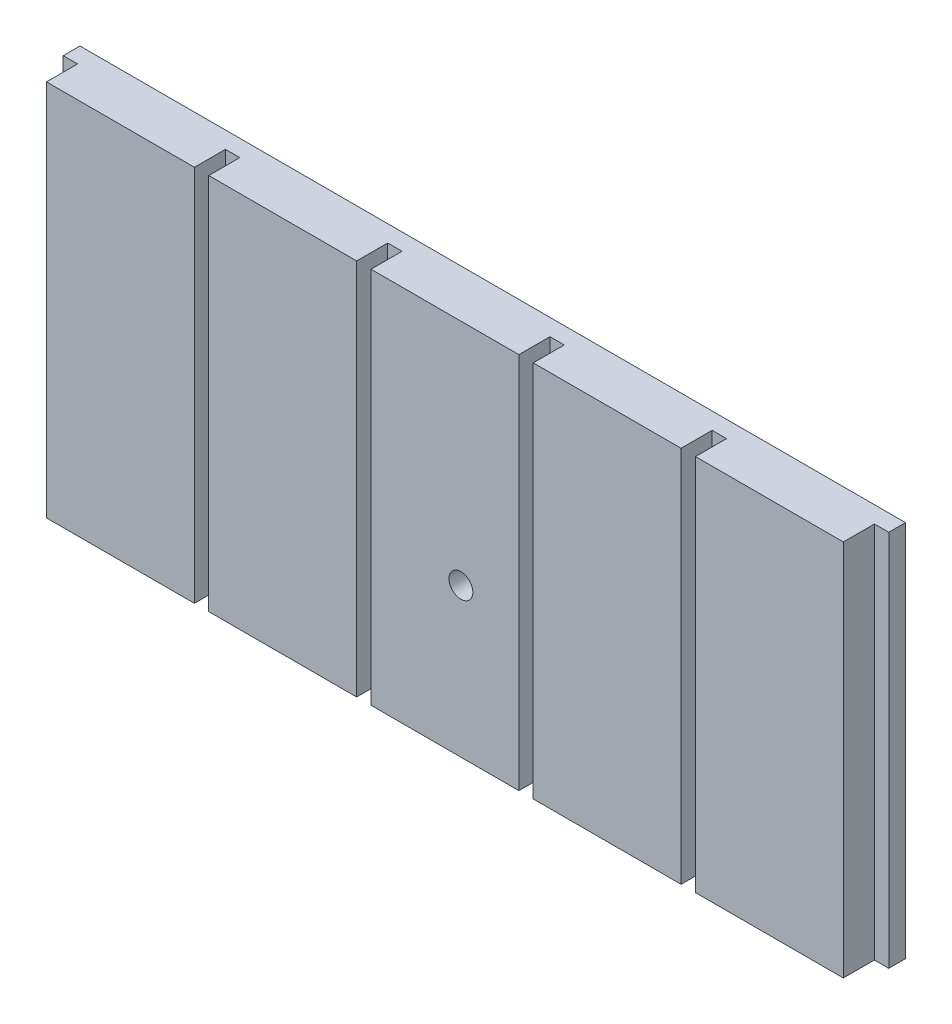
ISO-10303-21;
HEADER;
FILE_DESCRIPTION(('STEP AP214'),'2;1');
FILE_NAME('part.step','',(''),(''),'','','');
FILE_SCHEMA(('AUTOMOTIVE_DESIGN { 1 0 10303 214 1 1 1 1 }'));
ENDSEC;
DATA;
#1=APPLICATION_CONTEXT('core data for automotive mechanical design processes');
#2=APPLICATION_PROTOCOL_DEFINITION('international standard','automotive_design',2000,#1);
#3=PRODUCT_CONTEXT('',#1,'mechanical');
#4=PRODUCT('Part','Part','',(#3));
#5=PRODUCT_RELATED_PRODUCT_CATEGORY('part','',(#4));
#6=PRODUCT_DEFINITION_FORMATION('','',#4);
#7=PRODUCT_DEFINITION_CONTEXT('part definition',#1,'design');
#8=PRODUCT_DEFINITION('design','',#6,#7);
#9=PRODUCT_DEFINITION_SHAPE('','',#8);
#10=(LENGTH_UNIT() NAMED_UNIT(*) SI_UNIT(.MILLI.,.METRE.));
#11=(NAMED_UNIT(*) PLANE_ANGLE_UNIT() SI_UNIT($,.RADIAN.));
#12=(NAMED_UNIT(*) SI_UNIT($,.STERADIAN.) SOLID_ANGLE_UNIT());
#13=UNCERTAINTY_MEASURE_WITH_UNIT(LENGTH_MEASURE(1.E-05),#10,'distance_accuracy_value','');
#14=(GEOMETRIC_REPRESENTATION_CONTEXT(3) GLOBAL_UNCERTAINTY_ASSIGNED_CONTEXT((#13)) GLOBAL_UNIT_ASSIGNED_CONTEXT((#10,
#11,#12)) REPRESENTATION_CONTEXT('',''));
#15=CARTESIAN_POINT('',(0.,0.,0.));
#16=DIRECTION('',(0.,0.,1.));
#17=DIRECTION('',(1.,0.,0.));
#18=AXIS2_PLACEMENT_3D('',#15,#16,#17);
#19=CARTESIAN_POINT('',(0.,0.,0.));
#20=DIRECTION('',(0.,0.,1.));
#21=DIRECTION('',(-1.,0.,0.));
#22=AXIS2_PLACEMENT_3D('',#19,#20,#21);
#23=PLANE('',#22);
#24=DIRECTION('',(0.,1.,0.));
#25=VECTOR('',#24,1.);
#26=CARTESIAN_POINT('',(-49.4064909033683,-39.501,-9.47941669413857E-13));
#27=LINE('',#26,#25);
#28=CARTESIAN_POINT('',(-49.4064909033683,-39.4999999999999,-9.47941669413857E-13));
#29=VERTEX_POINT('',#28);
#30=CARTESIAN_POINT('',(-49.4064909033683,39.4999999999999,-9.47941669413857E-13));
#31=VERTEX_POINT('',#30);
#32=EDGE_CURVE('E349',#29,#31,#27,.T.);
#33=ORIENTED_EDGE('',*,*,#32,.F.);
#34=DIRECTION('',(1.,0.,0.));
#35=VECTOR('',#34,1.);
#36=CARTESIAN_POINT('',(-86.3441515056138,-39.4999999999999,0.));
#37=LINE('',#36,#35);
#38=CARTESIAN_POINT('',(-18.4688303011228,-39.4999999999999,0.));
#39=VERTEX_POINT('',#38);
#40=EDGE_CURVE('E231',#29,#39,#37,.T.);
#41=ORIENTED_EDGE('',*,*,#40,.T.);
#42=DIRECTION('',(0.,1.,0.));
#43=VECTOR('',#42,1.);
#44=CARTESIAN_POINT('',(-18.4688303011228,-39.501,-7.11507343120009E-13));
#45=LINE('',#44,#43);
#46=CARTESIAN_POINT('',(-18.4688303011228,39.4999999999999,-7.11507343120009E-13));
#47=VERTEX_POINT('',#46);
#48=EDGE_CURVE('E324',#39,#47,#45,.T.);
#49=ORIENTED_EDGE('',*,*,#48,.T.);
#50=DIRECTION('',(-1.,0.,0.));
#51=VECTOR('',#50,1.);
#52=CARTESIAN_POINT('',(-86.3441515056138,39.4999999999999,0.));
#53=LINE('',#52,#51);
#54=EDGE_CURVE('E388',#47,#31,#53,.T.);
#55=ORIENTED_EDGE('',*,*,#54,.T.);
#56=EDGE_LOOP('',(#33,#41,#49,#55));
#57=FACE_BOUND('',#56,.T.);
#58=ADVANCED_FACE('F37',(#57),#23,.T.);
#59=DIRECTION('',(0.,1.,0.));
#60=VECTOR('',#59,1.);
#61=CARTESIAN_POINT('',(-15.4688303011228,-39.501,-7.10956252060392E-13));
#62=LINE('',#61,#60);
#63=CARTESIAN_POINT('',(-15.4688303011228,-39.4999999999999,-7.10956252060392E-13));
#64=VERTEX_POINT('',#63);
#65=CARTESIAN_POINT('',(-15.4688303011228,39.4999999999999,-7.10956252060392E-13));
#66=VERTEX_POINT('',#65);
#67=EDGE_CURVE('E323',#64,#66,#62,.T.);
#68=ORIENTED_EDGE('',*,*,#67,.F.);
#69=CARTESIAN_POINT('',(15.4688303011228,-39.4999999999999,0.));
#70=VERTEX_POINT('',#69);
#71=EDGE_CURVE('E412',#64,#70,#37,.T.);
#72=ORIENTED_EDGE('',*,*,#71,.T.);
#73=DIRECTION('',(0.,1.,0.));
#74=VECTOR('',#73,1.);
#75=CARTESIAN_POINT('',(15.4688303011228,-39.501,-4.74521925766545E-13));
#76=LINE('',#75,#74);
#77=CARTESIAN_POINT('',(15.4688303011228,39.4999999999999,-4.74521925766545E-13));
#78=VERTEX_POINT('',#77);
#79=EDGE_CURVE('E298',#70,#78,#76,.T.);
#80=ORIENTED_EDGE('',*,*,#79,.T.);
#81=EDGE_CURVE('E390',#78,#66,#53,.T.);
#82=ORIENTED_EDGE('',*,*,#81,.T.);
#83=EDGE_LOOP('',(#68,#72,#80,#82));
#84=FACE_BOUND('',#83,.T.);
#85=CARTESIAN_POINT('',(3.3372047050014,-8.38677821628897,0.));
#86=DIRECTION('',(0.,0.,1.));
#87=DIRECTION('',(1.,0.,0.));
#88=AXIS2_PLACEMENT_3D('',#85,#86,#87);
#89=CIRCLE('',#88,2.5);
#90=CARTESIAN_POINT('',(5.8372047050014,-8.38677821628897,0.));
#91=VERTEX_POINT('',#90);
#92=EDGE_CURVE('E245',#91,#91,#89,.T.);
#93=ORIENTED_EDGE('',*,*,#92,.F.);
#94=EDGE_LOOP('',(#93));
#95=FACE_BOUND('',#94,.T.);
#96=ADVANCED_FACE('F445',(#84,#95),#23,.T.);
#97=DIRECTION('',(0.,1.,0.));
#98=VECTOR('',#97,1.);
#99=CARTESIAN_POINT('',(18.4688303011228,-39.501,-4.73970834706928E-13));
#100=LINE('',#99,#98);
#101=CARTESIAN_POINT('',(18.4688303011228,-39.4999999999999,-4.73970834706928E-13));
#102=VERTEX_POINT('',#101);
#103=CARTESIAN_POINT('',(18.4688303011228,39.4999999999999,-4.73970834706928E-13));
#104=VERTEX_POINT('',#103);
#105=EDGE_CURVE('E297',#102,#104,#100,.T.);
#106=ORIENTED_EDGE('',*,*,#105,.F.);
#107=CARTESIAN_POINT('',(49.4064909033683,-39.4999999999999,0.));
#108=VERTEX_POINT('',#107);
#109=EDGE_CURVE('E410',#102,#108,#37,.T.);
#110=ORIENTED_EDGE('',*,*,#109,.T.);
#111=DIRECTION('',(0.,1.,0.));
#112=VECTOR('',#111,1.);
#113=CARTESIAN_POINT('',(49.4064909033683,-39.501,-2.3753650841308E-13));
#114=LINE('',#113,#112);
#115=CARTESIAN_POINT('',(49.4064909033683,39.4999999999999,-2.3753650841308E-13));
#116=VERTEX_POINT('',#115);
#117=EDGE_CURVE('E272',#108,#116,#114,.T.);
#118=ORIENTED_EDGE('',*,*,#117,.T.);
#119=EDGE_CURVE('E236',#116,#104,#53,.T.);
#120=ORIENTED_EDGE('',*,*,#119,.T.);
#121=EDGE_LOOP('',(#106,#110,#118,#120));
#122=FACE_BOUND('',#121,.T.);
#123=ADVANCED_FACE('F402',(#122),#23,.T.);
#124=DIRECTION('',(0.,1.,0.));
#125=VECTOR('',#124,1.);
#126=CARTESIAN_POINT('',(52.4064909033683,-39.501,-2.36985417353464E-13));
#127=LINE('',#126,#125);
#128=CARTESIAN_POINT('',(52.4064909033683,-39.4999999999999,-2.36985417353464E-13));
#129=VERTEX_POINT('',#128);
#130=CARTESIAN_POINT('',(52.4064909033683,39.4999999999999,-2.36985417353464E-13));
#131=VERTEX_POINT('',#130);
#132=EDGE_CURVE('E271',#129,#131,#127,.T.);
#133=ORIENTED_EDGE('',*,*,#132,.F.);
#134=CARTESIAN_POINT('',(83.3441515056138,-39.4999999999999,0.));
#135=VERTEX_POINT('',#134);
#136=EDGE_CURVE('E232',#129,#135,#37,.T.);
#137=ORIENTED_EDGE('',*,*,#136,.T.);
#138=DIRECTION('',(0.,1.,0.));
#139=VECTOR('',#138,1.);
#140=CARTESIAN_POINT('',(83.3441515056138,-39.501,0.));
#141=LINE('',#140,#139);
#142=CARTESIAN_POINT('',(83.3441515056138,39.4999999999999,0.));
#143=VERTEX_POINT('',#142);
#144=EDGE_CURVE('E254',#135,#143,#141,.T.);
#145=ORIENTED_EDGE('',*,*,#144,.T.);
#146=EDGE_CURVE('E233',#143,#131,#53,.T.);
#147=ORIENTED_EDGE('',*,*,#146,.T.);
#148=EDGE_LOOP('',(#133,#137,#145,#147));
#149=FACE_BOUND('',#148,.T.);
#150=ADVANCED_FACE('F418',(#149),#23,.T.);
#151=CARTESIAN_POINT('',(0.,0.,-10.));
#152=DIRECTION('',(0.,0.,1.));
#153=DIRECTION('',(-1.,0.,0.));
#154=AXIS2_PLACEMENT_3D('',#151,#152,#153);
#155=PLANE('',#154);
#156=DIRECTION('',(0.,1.,0.));
#157=VECTOR('',#156,1.);
#158=CARTESIAN_POINT('',(86.3441515056138,-39.4999999999999,-10.));
#159=LINE('',#158,#157);
#160=CARTESIAN_POINT('',(86.3441515056138,-39.4999999999999,-10.));
#161=VERTEX_POINT('',#160);
#162=CARTESIAN_POINT('',(86.3441515056138,39.4999999999999,-10.));
#163=VERTEX_POINT('',#162);
#164=EDGE_CURVE('E230',#161,#163,#159,.T.);
#165=ORIENTED_EDGE('',*,*,#164,.F.);
#166=DIRECTION('',(1.,0.,0.));
#167=VECTOR('',#166,1.);
#168=CARTESIAN_POINT('',(-86.3441515056138,-39.4999999999999,-10.));
#169=LINE('',#168,#167);
#170=CARTESIAN_POINT('',(-86.3441515056138,-39.4999999999999,-10.));
#171=VERTEX_POINT('',#170);
#172=EDGE_CURVE('E226',#171,#161,#169,.T.);
#173=ORIENTED_EDGE('',*,*,#172,.F.);
#174=DIRECTION('',(0.,-1.,0.));
#175=VECTOR('',#174,1.);
#176=CARTESIAN_POINT('',(-86.3441515056138,-39.4999999999999,-10.));
#177=LINE('',#176,#175);
#178=CARTESIAN_POINT('',(-86.3441515056138,39.4999999999999,-10.));
#179=VERTEX_POINT('',#178);
#180=EDGE_CURVE('E240',#179,#171,#177,.T.);
#181=ORIENTED_EDGE('',*,*,#180,.F.);
#182=DIRECTION('',(-1.,0.,0.));
#183=VECTOR('',#182,1.);
#184=CARTESIAN_POINT('',(-86.3441515056138,39.4999999999999,-10.));
#185=LINE('',#184,#183);
#186=EDGE_CURVE('E219',#163,#179,#185,.T.);
#187=ORIENTED_EDGE('',*,*,#186,.F.);
#188=EDGE_LOOP('',(#165,#173,#181,#187));
#189=FACE_BOUND('',#188,.T.);
#190=CARTESIAN_POINT('',(3.3372047050014,-8.38677821628897,-10.));
#191=DIRECTION('',(0.,0.,1.));
#192=DIRECTION('',(1.,0.,0.));
#193=AXIS2_PLACEMENT_3D('',#190,#191,#192);
#194=CIRCLE('',#193,2.5);
#195=CARTESIAN_POINT('',(5.8372047050014,-8.38677821628897,-10.));
#196=VERTEX_POINT('',#195);
#197=EDGE_CURVE('E248',#196,#196,#194,.T.);
#198=ORIENTED_EDGE('',*,*,#197,.T.);
#199=EDGE_LOOP('',(#198));
#200=FACE_BOUND('',#199,.T.);
#201=ADVANCED_FACE('F453',(#189,#200),#155,.F.);
#202=DIRECTION('',(0.,1.,0.));
#203=VECTOR('',#202,1.);
#204=CARTESIAN_POINT('',(-83.3441515056138,-39.501,-1.18492708676732E-12));
#205=LINE('',#204,#203);
#206=CARTESIAN_POINT('',(-83.3441515056138,-39.4999999999999,-1.18492708676732E-12));
#207=VERTEX_POINT('',#206);
#208=CARTESIAN_POINT('',(-83.3441515056138,39.4999999999999,-1.18492708676732E-12));
#209=VERTEX_POINT('',#208);
#210=EDGE_CURVE('E371',#207,#209,#205,.T.);
#211=ORIENTED_EDGE('',*,*,#210,.F.);
#212=CARTESIAN_POINT('',(-52.4064909033683,-39.4999999999999,0.));
#213=VERTEX_POINT('',#212);
#214=EDGE_CURVE('E227',#207,#213,#37,.T.);
#215=ORIENTED_EDGE('',*,*,#214,.T.);
#216=DIRECTION('',(0.,1.,0.));
#217=VECTOR('',#216,1.);
#218=CARTESIAN_POINT('',(-52.4064909033683,-39.501,-9.48492760473473E-13));
#219=LINE('',#218,#217);
#220=CARTESIAN_POINT('',(-52.4064909033683,39.4999999999999,-9.48492760473473E-13));
#221=VERTEX_POINT('',#220);
#222=EDGE_CURVE('E350',#213,#221,#219,.T.);
#223=ORIENTED_EDGE('',*,*,#222,.T.);
#224=EDGE_CURVE('E237',#221,#209,#53,.T.);
#225=ORIENTED_EDGE('',*,*,#224,.T.);
#226=EDGE_LOOP('',(#211,#215,#223,#225));
#227=FACE_BOUND('',#226,.T.);
#228=ADVANCED_FACE('F386',(#227),#23,.T.);
#229=CARTESIAN_POINT('',(86.3441515056138,-39.4999999999999,-10.));
#230=DIRECTION('',(-1.,0.,0.));
#231=DIRECTION('',(0.,-1.,0.));
#232=AXIS2_PLACEMENT_3D('',#229,#230,#231);
#233=PLANE('',#232);
#234=DIRECTION('',(0.,0.,1.));
#235=VECTOR('',#234,1.);
#236=CARTESIAN_POINT('',(86.3441515056138,-39.4999999999999,-10.));
#237=LINE('',#236,#235);
#238=CARTESIAN_POINT('',(86.3441515056138,-39.4999999999999,-6.5));
#239=VERTEX_POINT('',#238);
#240=EDGE_CURVE('E221',#161,#239,#237,.T.);
#241=ORIENTED_EDGE('',*,*,#240,.F.);
#242=ORIENTED_EDGE('',*,*,#164,.T.);
#243=DIRECTION('',(0.,0.,1.));
#244=VECTOR('',#243,1.);
#245=CARTESIAN_POINT('',(86.3441515056138,39.4999999999999,-10.));
#246=LINE('',#245,#244);
#247=CARTESIAN_POINT('',(86.3441515056138,39.4999999999999,-6.5));
#248=VERTEX_POINT('',#247);
#249=EDGE_CURVE('E11',#163,#248,#246,.T.);
#250=ORIENTED_EDGE('',*,*,#249,.T.);
#251=DIRECTION('',(0.,1.,0.));
#252=VECTOR('',#251,1.);
#253=CARTESIAN_POINT('',(86.3441515056138,-39.501,-6.5));
#254=LINE('',#253,#252);
#255=EDGE_CURVE('E253',#239,#248,#254,.T.);
#256=ORIENTED_EDGE('',*,*,#255,.F.);
#257=EDGE_LOOP('',(#241,#242,#250,#256));
#258=FACE_BOUND('',#257,.T.);
#259=ADVANCED_FACE('F39',(#258),#233,.F.);
#260=CARTESIAN_POINT('',(-86.3441515056138,39.4999999999999,-10.));
#261=DIRECTION('',(0.,-1.,0.));
#262=DIRECTION('',(1.,0.,0.));
#263=AXIS2_PLACEMENT_3D('',#260,#261,#262);
#264=PLANE('',#263);
#265=ORIENTED_EDGE('',*,*,#224,.F.);
#266=DIRECTION('',(0.,0.,-1.));
#267=VECTOR('',#266,1.);
#268=CARTESIAN_POINT('',(-52.4064909033683,39.4999999999999,-9.48492760473473E-13));
#269=LINE('',#268,#267);
#270=CARTESIAN_POINT('',(-52.4064909033683,39.4999999999999,-6.50000000000095));
#271=VERTEX_POINT('',#270);
#272=EDGE_CURVE('E363',#221,#271,#269,.T.);
#273=ORIENTED_EDGE('',*,*,#272,.T.);
#274=DIRECTION('',(1.,0.,0.));
#275=VECTOR('',#274,1.);
#276=CARTESIAN_POINT('',(-49.4064909033683,39.4999999999999,-6.50000000000095));
#277=LINE('',#276,#275);
#278=CARTESIAN_POINT('',(-49.4064909033683,39.4999999999999,-6.50000000000095));
#279=VERTEX_POINT('',#278);
#280=EDGE_CURVE('E360',#271,#279,#277,.T.);
#281=ORIENTED_EDGE('',*,*,#280,.T.);
#282=DIRECTION('',(0.,0.,1.));
#283=VECTOR('',#282,1.);
#284=CARTESIAN_POINT('',(-49.4064909033683,39.4999999999999,-9.47941669413857E-13));
#285=LINE('',#284,#283);
#286=EDGE_CURVE('E353',#279,#31,#285,.T.);
#287=ORIENTED_EDGE('',*,*,#286,.T.);
#288=ORIENTED_EDGE('',*,*,#54,.F.);
#289=DIRECTION('',(0.,0.,-1.));
#290=VECTOR('',#289,1.);
#291=CARTESIAN_POINT('',(-18.4688303011228,39.4999999999999,-7.11507343120009E-13));
#292=LINE('',#291,#290);
#293=CARTESIAN_POINT('',(-18.4688303011228,39.4999999999999,-6.50000000000071));
#294=VERTEX_POINT('',#293);
#295=EDGE_CURVE('E338',#47,#294,#292,.T.);
#296=ORIENTED_EDGE('',*,*,#295,.T.);
#297=DIRECTION('',(1.,0.,0.));
#298=VECTOR('',#297,1.);
#299=CARTESIAN_POINT('',(-15.4688303011228,39.4999999999999,-6.50000000000071));
#300=LINE('',#299,#298);
#301=CARTESIAN_POINT('',(-15.4688303011228,39.4999999999999,-6.50000000000071));
#302=VERTEX_POINT('',#301);
#303=EDGE_CURVE('E335',#294,#302,#300,.T.);
#304=ORIENTED_EDGE('',*,*,#303,.T.);
#305=DIRECTION('',(0.,0.,1.));
#306=VECTOR('',#305,1.);
#307=CARTESIAN_POINT('',(-15.4688303011228,39.4999999999999,-7.10956252060392E-13));
#308=LINE('',#307,#306);
#309=EDGE_CURVE('E328',#302,#66,#308,.T.);
#310=ORIENTED_EDGE('',*,*,#309,.T.);
#311=ORIENTED_EDGE('',*,*,#81,.F.);
#312=DIRECTION('',(0.,0.,-1.));
#313=VECTOR('',#312,1.);
#314=CARTESIAN_POINT('',(15.4688303011228,39.4999999999999,-4.74521925766545E-13));
#315=LINE('',#314,#313);
#316=CARTESIAN_POINT('',(15.4688303011228,39.4999999999999,-6.50000000000047));
#317=VERTEX_POINT('',#316);
#318=EDGE_CURVE('E312',#78,#317,#315,.T.);
#319=ORIENTED_EDGE('',*,*,#318,.T.);
#320=DIRECTION('',(1.,0.,0.));
#321=VECTOR('',#320,1.);
#322=CARTESIAN_POINT('',(18.4688303011228,39.4999999999999,-6.50000000000047));
#323=LINE('',#322,#321);
#324=CARTESIAN_POINT('',(18.4688303011228,39.4999999999999,-6.50000000000047));
#325=VERTEX_POINT('',#324);
#326=EDGE_CURVE('E309',#317,#325,#323,.T.);
#327=ORIENTED_EDGE('',*,*,#326,.T.);
#328=DIRECTION('',(0.,0.,1.));
#329=VECTOR('',#328,1.);
#330=CARTESIAN_POINT('',(18.4688303011228,39.4999999999999,-4.73970834706928E-13));
#331=LINE('',#330,#329);
#332=EDGE_CURVE('E302',#325,#104,#331,.T.);
#333=ORIENTED_EDGE('',*,*,#332,.T.);
#334=ORIENTED_EDGE('',*,*,#119,.F.);
#335=DIRECTION('',(0.,0.,-1.));
#336=VECTOR('',#335,1.);
#337=CARTESIAN_POINT('',(49.4064909033683,39.4999999999999,-2.3753650841308E-13));
#338=LINE('',#337,#336);
#339=CARTESIAN_POINT('',(49.4064909033683,39.4999999999999,-6.50000000000024));
#340=VERTEX_POINT('',#339);
#341=EDGE_CURVE('E286',#116,#340,#338,.T.);
#342=ORIENTED_EDGE('',*,*,#341,.T.);
#343=DIRECTION('',(1.,0.,0.));
#344=VECTOR('',#343,1.);
#345=CARTESIAN_POINT('',(52.4064909033683,39.4999999999999,-6.50000000000024));
#346=LINE('',#345,#344);
#347=CARTESIAN_POINT('',(52.4064909033683,39.4999999999999,-6.50000000000024));
#348=VERTEX_POINT('',#347);
#349=EDGE_CURVE('E283',#340,#348,#346,.T.);
#350=ORIENTED_EDGE('',*,*,#349,.T.);
#351=DIRECTION('',(0.,0.,1.));
#352=VECTOR('',#351,1.);
#353=CARTESIAN_POINT('',(52.4064909033683,39.4999999999999,-2.36985417353464E-13));
#354=LINE('',#353,#352);
#355=EDGE_CURVE('E276',#348,#131,#354,.T.);
#356=ORIENTED_EDGE('',*,*,#355,.T.);
#357=ORIENTED_EDGE('',*,*,#146,.F.);
#358=DIRECTION('',(0.,0.,-1.));
#359=VECTOR('',#358,1.);
#360=CARTESIAN_POINT('',(83.3441515056138,39.4999999999999,0.));
#361=LINE('',#360,#359);
#362=CARTESIAN_POINT('',(83.3441515056138,39.4999999999999,-6.5));
#363=VERTEX_POINT('',#362);
#364=EDGE_CURVE('E263',#143,#363,#361,.T.);
#365=ORIENTED_EDGE('',*,*,#364,.T.);
#366=DIRECTION('',(1.,0.,0.));
#367=VECTOR('',#366,1.);
#368=CARTESIAN_POINT('',(86.3441515056138,39.4999999999999,-6.5));
#369=LINE('',#368,#367);
#370=EDGE_CURVE('E258',#363,#248,#369,.T.);
#371=ORIENTED_EDGE('',*,*,#370,.T.);
#372=ORIENTED_EDGE('',*,*,#249,.F.);
#373=ORIENTED_EDGE('',*,*,#186,.T.);
#374=DIRECTION('',(0.,0.,1.));
#375=VECTOR('',#374,1.);
#376=CARTESIAN_POINT('',(-86.3441515056138,39.4999999999999,-10.));
#377=LINE('',#376,#375);
#378=CARTESIAN_POINT('',(-86.3441515056138,39.4999999999999,-6.50000000000118));
#379=VERTEX_POINT('',#378);
#380=EDGE_CURVE('E45',#179,#379,#377,.T.);
#381=ORIENTED_EDGE('',*,*,#380,.T.);
#382=DIRECTION('',(1.,0.,0.));
#383=VECTOR('',#382,1.);
#384=CARTESIAN_POINT('',(-83.3441515056138,39.4999999999999,-6.50000000000118));
#385=LINE('',#384,#383);
#386=CARTESIAN_POINT('',(-83.3441515056138,39.4999999999999,-6.50000000000118));
#387=VERTEX_POINT('',#386);
#388=EDGE_CURVE('E211',#379,#387,#385,.T.);
#389=ORIENTED_EDGE('',*,*,#388,.T.);
#390=DIRECTION('',(0.,0.,1.));
#391=VECTOR('',#390,1.);
#392=CARTESIAN_POINT('',(-83.3441515056138,39.4999999999999,-1.18492708676732E-12));
#393=LINE('',#392,#391);
#394=EDGE_CURVE('E208',#387,#209,#393,.T.);
#395=ORIENTED_EDGE('',*,*,#394,.T.);
#396=EDGE_LOOP('',(#265,#273,#281,#287,#288,#296,#304,#310,#311,#319,#327,#333,#334,#342,#350,
#356,#357,#365,#371,#372,#373,#381,#389,#395));
#397=FACE_BOUND('',#396,.T.);
#398=ADVANCED_FACE('F217',(#397),#264,.F.);
#399=CARTESIAN_POINT('',(-86.3441515056138,-39.4999999999999,-10.));
#400=DIRECTION('',(1.,0.,0.));
#401=DIRECTION('',(0.,1.,0.));
#402=AXIS2_PLACEMENT_3D('',#399,#400,#401);
#403=PLANE('',#402);
#404=ORIENTED_EDGE('',*,*,#380,.F.);
#405=ORIENTED_EDGE('',*,*,#180,.T.);
#406=DIRECTION('',(0.,0.,1.));
#407=VECTOR('',#406,1.);
#408=CARTESIAN_POINT('',(-86.3441515056138,-39.4999999999999,-10.));
#409=LINE('',#408,#407);
#410=CARTESIAN_POINT('',(-86.3441515056138,-39.4999999999999,-6.50000000000118));
#411=VERTEX_POINT('',#410);
#412=EDGE_CURVE('E205',#171,#411,#409,.T.);
#413=ORIENTED_EDGE('',*,*,#412,.T.);
#414=DIRECTION('',(0.,1.,0.));
#415=VECTOR('',#414,1.);
#416=CARTESIAN_POINT('',(-86.3441515056138,-39.501,-6.50000000000118));
#417=LINE('',#416,#415);
#418=EDGE_CURVE('E199',#411,#379,#417,.T.);
#419=ORIENTED_EDGE('',*,*,#418,.T.);
#420=EDGE_LOOP('',(#404,#405,#413,#419));
#421=FACE_BOUND('',#420,.T.);
#422=ADVANCED_FACE('F201',(#421),#403,.F.);
#423=CARTESIAN_POINT('',(-86.3441515056138,-39.4999999999999,-10.));
#424=DIRECTION('',(0.,1.,0.));
#425=DIRECTION('',(0.,0.,-1.));
#426=AXIS2_PLACEMENT_3D('',#423,#424,#425);
#427=PLANE('',#426);
#428=DIRECTION('',(-1.,0.,0.));
#429=VECTOR('',#428,1.);
#430=CARTESIAN_POINT('',(-83.3441515056138,-39.4999999999999,-6.50000000000118));
#431=LINE('',#430,#429);
#432=CARTESIAN_POINT('',(-83.3441515056138,-39.4999999999999,-6.50000000000118));
#433=VERTEX_POINT('',#432);
#434=EDGE_CURVE('E378',#433,#411,#431,.T.);
#435=ORIENTED_EDGE('',*,*,#434,.T.);
#436=ORIENTED_EDGE('',*,*,#412,.F.);
#437=ORIENTED_EDGE('',*,*,#172,.T.);
#438=ORIENTED_EDGE('',*,*,#240,.T.);
#439=DIRECTION('',(-1.,0.,0.));
#440=VECTOR('',#439,1.);
#441=CARTESIAN_POINT('',(86.3441515056138,-39.4999999999999,-6.5));
#442=LINE('',#441,#440);
#443=CARTESIAN_POINT('',(83.3441515056138,-39.4999999999999,-6.5));
#444=VERTEX_POINT('',#443);
#445=EDGE_CURVE('E266',#239,#444,#442,.T.);
#446=ORIENTED_EDGE('',*,*,#445,.T.);
#447=DIRECTION('',(0.,0.,1.));
#448=VECTOR('',#447,1.);
#449=CARTESIAN_POINT('',(83.3441515056138,-39.4999999999999,0.));
#450=LINE('',#449,#448);
#451=EDGE_CURVE('E249',#444,#135,#450,.T.);
#452=ORIENTED_EDGE('',*,*,#451,.T.);
#453=ORIENTED_EDGE('',*,*,#136,.F.);
#454=DIRECTION('',(0.,0.,-1.));
#455=VECTOR('',#454,1.);
#456=CARTESIAN_POINT('',(52.4064909033683,-39.4999999999999,-2.36985417353464E-13));
#457=LINE('',#456,#455);
#458=CARTESIAN_POINT('',(52.4064909033683,-39.4999999999999,-6.50000000000024));
#459=VERTEX_POINT('',#458);
#460=EDGE_CURVE('E289',#129,#459,#457,.T.);
#461=ORIENTED_EDGE('',*,*,#460,.T.);
#462=DIRECTION('',(-1.,0.,0.));
#463=VECTOR('',#462,1.);
#464=CARTESIAN_POINT('',(52.4064909033683,-39.4999999999999,-6.50000000000024));
#465=LINE('',#464,#463);
#466=CARTESIAN_POINT('',(49.4064909033683,-39.4999999999999,-6.50000000000024));
#467=VERTEX_POINT('',#466);
#468=EDGE_CURVE('E292',#459,#467,#465,.T.);
#469=ORIENTED_EDGE('',*,*,#468,.T.);
#470=DIRECTION('',(0.,0.,1.));
#471=VECTOR('',#470,1.);
#472=CARTESIAN_POINT('',(49.4064909033683,-39.4999999999999,-2.3753650841308E-13));
#473=LINE('',#472,#471);
#474=EDGE_CURVE('E269',#467,#108,#473,.T.);
#475=ORIENTED_EDGE('',*,*,#474,.T.);
#476=ORIENTED_EDGE('',*,*,#109,.F.);
#477=DIRECTION('',(0.,0.,-1.));
#478=VECTOR('',#477,1.);
#479=CARTESIAN_POINT('',(18.4688303011228,-39.4999999999999,-4.73970834706928E-13));
#480=LINE('',#479,#478);
#481=CARTESIAN_POINT('',(18.4688303011228,-39.4999999999999,-6.50000000000047));
#482=VERTEX_POINT('',#481);
#483=EDGE_CURVE('E315',#102,#482,#480,.T.);
#484=ORIENTED_EDGE('',*,*,#483,.T.);
#485=DIRECTION('',(-1.,0.,0.));
#486=VECTOR('',#485,1.);
#487=CARTESIAN_POINT('',(18.4688303011228,-39.4999999999999,-6.50000000000047));
#488=LINE('',#487,#486);
#489=CARTESIAN_POINT('',(15.4688303011228,-39.4999999999999,-6.50000000000047));
#490=VERTEX_POINT('',#489);
#491=EDGE_CURVE('E318',#482,#490,#488,.T.);
#492=ORIENTED_EDGE('',*,*,#491,.T.);
#493=DIRECTION('',(0.,0.,1.));
#494=VECTOR('',#493,1.);
#495=CARTESIAN_POINT('',(15.4688303011228,-39.4999999999999,-4.74521925766545E-13));
#496=LINE('',#495,#494);
#497=EDGE_CURVE('E295',#490,#70,#496,.T.);
#498=ORIENTED_EDGE('',*,*,#497,.T.);
#499=ORIENTED_EDGE('',*,*,#71,.F.);
#500=DIRECTION('',(0.,0.,-1.));
#501=VECTOR('',#500,1.);
#502=CARTESIAN_POINT('',(-15.4688303011228,-39.4999999999999,-7.10956252060392E-13));
#503=LINE('',#502,#501);
#504=CARTESIAN_POINT('',(-15.4688303011228,-39.4999999999999,-6.50000000000071));
#505=VERTEX_POINT('',#504);
#506=EDGE_CURVE('E341',#64,#505,#503,.T.);
#507=ORIENTED_EDGE('',*,*,#506,.T.);
#508=DIRECTION('',(-1.,0.,0.));
#509=VECTOR('',#508,1.);
#510=CARTESIAN_POINT('',(-15.4688303011228,-39.4999999999999,-6.50000000000071));
#511=LINE('',#510,#509);
#512=CARTESIAN_POINT('',(-18.4688303011228,-39.4999999999999,-6.50000000000071));
#513=VERTEX_POINT('',#512);
#514=EDGE_CURVE('E344',#505,#513,#511,.T.);
#515=ORIENTED_EDGE('',*,*,#514,.T.);
#516=DIRECTION('',(0.,0.,1.));
#517=VECTOR('',#516,1.);
#518=CARTESIAN_POINT('',(-18.4688303011228,-39.4999999999999,-7.11507343120009E-13));
#519=LINE('',#518,#517);
#520=EDGE_CURVE('E321',#513,#39,#519,.T.);
#521=ORIENTED_EDGE('',*,*,#520,.T.);
#522=ORIENTED_EDGE('',*,*,#40,.F.);
#523=DIRECTION('',(0.,0.,-1.));
#524=VECTOR('',#523,1.);
#525=CARTESIAN_POINT('',(-49.4064909033683,-39.4999999999999,-9.47941669413857E-13));
#526=LINE('',#525,#524);
#527=CARTESIAN_POINT('',(-49.4064909033683,-39.4999999999999,-6.50000000000095));
#528=VERTEX_POINT('',#527);
#529=EDGE_CURVE('E366',#29,#528,#526,.T.);
#530=ORIENTED_EDGE('',*,*,#529,.T.);
#531=DIRECTION('',(-1.,0.,0.));
#532=VECTOR('',#531,1.);
#533=CARTESIAN_POINT('',(-49.4064909033683,-39.4999999999999,-6.50000000000095));
#534=LINE('',#533,#532);
#535=CARTESIAN_POINT('',(-52.4064909033683,-39.4999999999999,-6.50000000000095));
#536=VERTEX_POINT('',#535);
#537=EDGE_CURVE('E369',#528,#536,#534,.T.);
#538=ORIENTED_EDGE('',*,*,#537,.T.);
#539=DIRECTION('',(0.,0.,1.));
#540=VECTOR('',#539,1.);
#541=CARTESIAN_POINT('',(-52.4064909033683,-39.4999999999999,-9.48492760473473E-13));
#542=LINE('',#541,#540);
#543=EDGE_CURVE('E347',#536,#213,#542,.T.);
#544=ORIENTED_EDGE('',*,*,#543,.T.);
#545=ORIENTED_EDGE('',*,*,#214,.F.);
#546=DIRECTION('',(0.,0.,-1.));
#547=VECTOR('',#546,1.);
#548=CARTESIAN_POINT('',(-83.3441515056138,-39.4999999999999,-1.18492708676732E-12));
#549=LINE('',#548,#547);
#550=EDGE_CURVE('E214',#207,#433,#549,.T.);
#551=ORIENTED_EDGE('',*,*,#550,.T.);
#552=EDGE_LOOP('',(#435,#436,#437,#438,#446,#452,#453,#461,#469,#475,#476,#484,#492,#498,#499,
#507,#515,#521,#522,#530,#538,#544,#545,#551));
#553=FACE_BOUND('',#552,.T.);
#554=ADVANCED_FACE('F380',(#553),#427,.F.);
#555=CARTESIAN_POINT('',(3.3372047050014,-8.38677821628897,-10.));
#556=DIRECTION('',(0.,0.,1.));
#557=DIRECTION('',(-1.,0.,0.));
#558=AXIS2_PLACEMENT_3D('',#555,#556,#557);
#559=CYLINDRICAL_SURFACE('',#558,2.5);
#560=ORIENTED_EDGE('',*,*,#197,.F.);
#561=EDGE_LOOP('',(#560));
#562=FACE_BOUND('',#561,.T.);
#563=ORIENTED_EDGE('',*,*,#92,.T.);
#564=EDGE_LOOP('',(#563));
#565=FACE_BOUND('',#564,.T.);
#566=ADVANCED_FACE('F517',(#562,#565),#559,.F.);
#567=CARTESIAN_POINT('',(86.3441515056138,-39.501,-6.5));
#568=DIRECTION('',(0.,0.,-1.));
#569=DIRECTION('',(1.,0.,0.));
#570=AXIS2_PLACEMENT_3D('',#567,#568,#569);
#571=PLANE('',#570);
#572=ORIENTED_EDGE('',*,*,#445,.F.);
#573=ORIENTED_EDGE('',*,*,#255,.T.);
#574=ORIENTED_EDGE('',*,*,#370,.F.);
#575=DIRECTION('',(0.,1.,0.));
#576=VECTOR('',#575,1.);
#577=CARTESIAN_POINT('',(83.3441515056138,-39.501,-6.5));
#578=LINE('',#577,#576);
#579=EDGE_CURVE('E257',#444,#363,#578,.T.);
#580=ORIENTED_EDGE('',*,*,#579,.F.);
#581=EDGE_LOOP('',(#572,#573,#574,#580));
#582=FACE_BOUND('',#581,.T.);
#583=ADVANCED_FACE('F524',(#582),#571,.F.);
#584=CARTESIAN_POINT('',(83.3441515056138,-39.501,0.));
#585=DIRECTION('',(-1.,0.,0.));
#586=DIRECTION('',(0.,0.,-1.));
#587=AXIS2_PLACEMENT_3D('',#584,#585,#586);
#588=PLANE('',#587);
#589=ORIENTED_EDGE('',*,*,#451,.F.);
#590=ORIENTED_EDGE('',*,*,#579,.T.);
#591=ORIENTED_EDGE('',*,*,#364,.F.);
#592=ORIENTED_EDGE('',*,*,#144,.F.);
#593=EDGE_LOOP('',(#589,#590,#591,#592));
#594=FACE_BOUND('',#593,.T.);
#595=ADVANCED_FACE('F422',(#594),#588,.F.);
#596=CARTESIAN_POINT('',(52.4064909033683,-39.501,-2.36985417353464E-13));
#597=DIRECTION('',(1.,0.,0.));
#598=DIRECTION('',(0.,0.,1.));
#599=AXIS2_PLACEMENT_3D('',#596,#597,#598);
#600=PLANE('',#599);
#601=ORIENTED_EDGE('',*,*,#460,.F.);
#602=ORIENTED_EDGE('',*,*,#132,.T.);
#603=ORIENTED_EDGE('',*,*,#355,.F.);
#604=DIRECTION('',(0.,1.,0.));
#605=VECTOR('',#604,1.);
#606=CARTESIAN_POINT('',(52.4064909033683,-39.501,-6.50000000000024));
#607=LINE('',#606,#605);
#608=EDGE_CURVE('E278',#459,#348,#607,.T.);
#609=ORIENTED_EDGE('',*,*,#608,.F.);
#610=EDGE_LOOP('',(#601,#602,#603,#609));
#611=FACE_BOUND('',#610,.T.);
#612=ADVANCED_FACE('F427',(#611),#600,.F.);
#613=CARTESIAN_POINT('',(52.4064909033683,-39.501,-6.50000000000024));
#614=DIRECTION('',(0.,0.,-1.));
#615=DIRECTION('',(1.,0.,0.));
#616=AXIS2_PLACEMENT_3D('',#613,#614,#615);
#617=PLANE('',#616);
#618=ORIENTED_EDGE('',*,*,#468,.F.);
#619=ORIENTED_EDGE('',*,*,#608,.T.);
#620=ORIENTED_EDGE('',*,*,#349,.F.);
#621=DIRECTION('',(0.,1.,0.));
#622=VECTOR('',#621,1.);
#623=CARTESIAN_POINT('',(49.4064909033683,-39.501,-6.50000000000024));
#624=LINE('',#623,#622);
#625=EDGE_CURVE('E275',#467,#340,#624,.T.);
#626=ORIENTED_EDGE('',*,*,#625,.F.);
#627=EDGE_LOOP('',(#618,#619,#620,#626));
#628=FACE_BOUND('',#627,.T.);
#629=ADVANCED_FACE('F431',(#628),#617,.F.);
#630=CARTESIAN_POINT('',(49.4064909033683,-39.501,-2.3753650841308E-13));
#631=DIRECTION('',(-1.,0.,0.));
#632=DIRECTION('',(0.,0.,-1.));
#633=AXIS2_PLACEMENT_3D('',#630,#631,#632);
#634=PLANE('',#633);
#635=ORIENTED_EDGE('',*,*,#474,.F.);
#636=ORIENTED_EDGE('',*,*,#625,.T.);
#637=ORIENTED_EDGE('',*,*,#341,.F.);
#638=ORIENTED_EDGE('',*,*,#117,.F.);
#639=EDGE_LOOP('',(#635,#636,#637,#638));
#640=FACE_BOUND('',#639,.T.);
#641=ADVANCED_FACE('F433',(#640),#634,.F.);
#642=CARTESIAN_POINT('',(18.4688303011228,-39.501,-4.73970834706928E-13));
#643=DIRECTION('',(1.,0.,0.));
#644=DIRECTION('',(0.,0.,1.));
#645=AXIS2_PLACEMENT_3D('',#642,#643,#644);
#646=PLANE('',#645);
#647=ORIENTED_EDGE('',*,*,#483,.F.);
#648=ORIENTED_EDGE('',*,*,#105,.T.);
#649=ORIENTED_EDGE('',*,*,#332,.F.);
#650=DIRECTION('',(0.,1.,0.));
#651=VECTOR('',#650,1.);
#652=CARTESIAN_POINT('',(18.4688303011228,-39.501,-6.50000000000047));
#653=LINE('',#652,#651);
#654=EDGE_CURVE('E304',#482,#325,#653,.T.);
#655=ORIENTED_EDGE('',*,*,#654,.F.);
#656=EDGE_LOOP('',(#647,#648,#649,#655));
#657=FACE_BOUND('',#656,.T.);
#658=ADVANCED_FACE('F407',(#657),#646,.F.);
#659=CARTESIAN_POINT('',(18.4688303011228,-39.501,-6.50000000000047));
#660=DIRECTION('',(0.,0.,-1.));
#661=DIRECTION('',(1.,0.,0.));
#662=AXIS2_PLACEMENT_3D('',#659,#660,#661);
#663=PLANE('',#662);
#664=ORIENTED_EDGE('',*,*,#491,.F.);
#665=ORIENTED_EDGE('',*,*,#654,.T.);
#666=ORIENTED_EDGE('',*,*,#326,.F.);
#667=DIRECTION('',(0.,1.,0.));
#668=VECTOR('',#667,1.);
#669=CARTESIAN_POINT('',(15.4688303011228,-39.501,-6.50000000000047));
#670=LINE('',#669,#668);
#671=EDGE_CURVE('E301',#490,#317,#670,.T.);
#672=ORIENTED_EDGE('',*,*,#671,.F.);
#673=EDGE_LOOP('',(#664,#665,#666,#672));
#674=FACE_BOUND('',#673,.T.);
#675=ADVANCED_FACE('F440',(#674),#663,.F.);
#676=CARTESIAN_POINT('',(15.4688303011228,-39.501,-4.74521925766545E-13));
#677=DIRECTION('',(-1.,0.,0.));
#678=DIRECTION('',(0.,0.,-1.));
#679=AXIS2_PLACEMENT_3D('',#676,#677,#678);
#680=PLANE('',#679);
#681=ORIENTED_EDGE('',*,*,#497,.F.);
#682=ORIENTED_EDGE('',*,*,#671,.T.);
#683=ORIENTED_EDGE('',*,*,#318,.F.);
#684=ORIENTED_EDGE('',*,*,#79,.F.);
#685=EDGE_LOOP('',(#681,#682,#683,#684));
#686=FACE_BOUND('',#685,.T.);
#687=ADVANCED_FACE('F568',(#686),#680,.F.);
#688=CARTESIAN_POINT('',(-15.4688303011228,-39.501,-7.10956252060392E-13));
#689=DIRECTION('',(1.,0.,0.));
#690=DIRECTION('',(0.,0.,1.));
#691=AXIS2_PLACEMENT_3D('',#688,#689,#690);
#692=PLANE('',#691);
#693=ORIENTED_EDGE('',*,*,#506,.F.);
#694=ORIENTED_EDGE('',*,*,#67,.T.);
#695=ORIENTED_EDGE('',*,*,#309,.F.);
#696=DIRECTION('',(0.,1.,0.));
#697=VECTOR('',#696,1.);
#698=CARTESIAN_POINT('',(-15.4688303011228,-39.501,-6.50000000000071));
#699=LINE('',#698,#697);
#700=EDGE_CURVE('E330',#505,#302,#699,.T.);
#701=ORIENTED_EDGE('',*,*,#700,.F.);
#702=EDGE_LOOP('',(#693,#694,#695,#701));
#703=FACE_BOUND('',#702,.T.);
#704=ADVANCED_FACE('F577',(#703),#692,.F.);
#705=CARTESIAN_POINT('',(-15.4688303011228,-39.501,-6.50000000000071));
#706=DIRECTION('',(0.,0.,-1.));
#707=DIRECTION('',(1.,0.,0.));
#708=AXIS2_PLACEMENT_3D('',#705,#706,#707);
#709=PLANE('',#708);
#710=ORIENTED_EDGE('',*,*,#514,.F.);
#711=ORIENTED_EDGE('',*,*,#700,.T.);
#712=ORIENTED_EDGE('',*,*,#303,.F.);
#713=DIRECTION('',(0.,1.,0.));
#714=VECTOR('',#713,1.);
#715=CARTESIAN_POINT('',(-18.4688303011228,-39.501,-6.50000000000071));
#716=LINE('',#715,#714);
#717=EDGE_CURVE('E327',#513,#294,#716,.T.);
#718=ORIENTED_EDGE('',*,*,#717,.F.);
#719=EDGE_LOOP('',(#710,#711,#712,#718));
#720=FACE_BOUND('',#719,.T.);
#721=ADVANCED_FACE('F586',(#720),#709,.F.);
#722=CARTESIAN_POINT('',(-18.4688303011228,-39.501,-7.11507343120009E-13));
#723=DIRECTION('',(-1.,0.,0.));
#724=DIRECTION('',(0.,0.,-1.));
#725=AXIS2_PLACEMENT_3D('',#722,#723,#724);
#726=PLANE('',#725);
#727=ORIENTED_EDGE('',*,*,#520,.F.);
#728=ORIENTED_EDGE('',*,*,#717,.T.);
#729=ORIENTED_EDGE('',*,*,#295,.F.);
#730=ORIENTED_EDGE('',*,*,#48,.F.);
#731=EDGE_LOOP('',(#727,#728,#729,#730));
#732=FACE_BOUND('',#731,.T.);
#733=ADVANCED_FACE('F595',(#732),#726,.F.);
#734=CARTESIAN_POINT('',(-49.4064909033683,-39.501,-9.47941669413857E-13));
#735=DIRECTION('',(1.,0.,0.));
#736=DIRECTION('',(0.,0.,1.));
#737=AXIS2_PLACEMENT_3D('',#734,#735,#736);
#738=PLANE('',#737);
#739=ORIENTED_EDGE('',*,*,#529,.F.);
#740=ORIENTED_EDGE('',*,*,#32,.T.);
#741=ORIENTED_EDGE('',*,*,#286,.F.);
#742=DIRECTION('',(0.,1.,0.));
#743=VECTOR('',#742,1.);
#744=CARTESIAN_POINT('',(-49.4064909033683,-39.501,-6.50000000000095));
#745=LINE('',#744,#743);
#746=EDGE_CURVE('E355',#528,#279,#745,.T.);
#747=ORIENTED_EDGE('',*,*,#746,.F.);
#748=EDGE_LOOP('',(#739,#740,#741,#747));
#749=FACE_BOUND('',#748,.T.);
#750=ADVANCED_FACE('F604',(#749),#738,.F.);
#751=CARTESIAN_POINT('',(-49.4064909033683,-39.501,-6.50000000000095));
#752=DIRECTION('',(0.,0.,-1.));
#753=DIRECTION('',(1.,0.,0.));
#754=AXIS2_PLACEMENT_3D('',#751,#752,#753);
#755=PLANE('',#754);
#756=ORIENTED_EDGE('',*,*,#537,.F.);
#757=ORIENTED_EDGE('',*,*,#746,.T.);
#758=ORIENTED_EDGE('',*,*,#280,.F.);
#759=DIRECTION('',(0.,1.,0.));
#760=VECTOR('',#759,1.);
#761=CARTESIAN_POINT('',(-52.4064909033683,-39.501,-6.50000000000095));
#762=LINE('',#761,#760);
#763=EDGE_CURVE('E60',#536,#271,#762,.T.);
#764=ORIENTED_EDGE('',*,*,#763,.F.);
#765=EDGE_LOOP('',(#756,#757,#758,#764));
#766=FACE_BOUND('',#765,.T.);
#767=ADVANCED_FACE('F613',(#766),#755,.F.);
#768=CARTESIAN_POINT('',(-52.4064909033683,-39.501,-9.48492760473473E-13));
#769=DIRECTION('',(-1.,0.,0.));
#770=DIRECTION('',(0.,0.,-1.));
#771=AXIS2_PLACEMENT_3D('',#768,#769,#770);
#772=PLANE('',#771);
#773=ORIENTED_EDGE('',*,*,#543,.F.);
#774=ORIENTED_EDGE('',*,*,#763,.T.);
#775=ORIENTED_EDGE('',*,*,#272,.F.);
#776=ORIENTED_EDGE('',*,*,#222,.F.);
#777=EDGE_LOOP('',(#773,#774,#775,#776));
#778=FACE_BOUND('',#777,.T.);
#779=ADVANCED_FACE('F622',(#778),#772,.F.);
#780=CARTESIAN_POINT('',(-83.3441515056138,-39.501,-1.18492708676732E-12));
#781=DIRECTION('',(1.,0.,0.));
#782=DIRECTION('',(0.,0.,1.));
#783=AXIS2_PLACEMENT_3D('',#780,#781,#782);
#784=PLANE('',#783);
#785=ORIENTED_EDGE('',*,*,#550,.F.);
#786=ORIENTED_EDGE('',*,*,#210,.T.);
#787=ORIENTED_EDGE('',*,*,#394,.F.);
#788=DIRECTION('',(0.,1.,0.));
#789=VECTOR('',#788,1.);
#790=CARTESIAN_POINT('',(-83.3441515056138,-39.501,-6.50000000000118));
#791=LINE('',#790,#789);
#792=EDGE_CURVE('E52',#433,#387,#791,.T.);
#793=ORIENTED_EDGE('',*,*,#792,.F.);
#794=EDGE_LOOP('',(#785,#786,#787,#793));
#795=FACE_BOUND('',#794,.T.);
#796=ADVANCED_FACE('F383',(#795),#784,.F.);
#797=CARTESIAN_POINT('',(-83.3441515056138,-39.501,-6.50000000000118));
#798=DIRECTION('',(0.,0.,-1.));
#799=DIRECTION('',(1.,0.,0.));
#800=AXIS2_PLACEMENT_3D('',#797,#798,#799);
#801=PLANE('',#800);
#802=ORIENTED_EDGE('',*,*,#434,.F.);
#803=ORIENTED_EDGE('',*,*,#792,.T.);
#804=ORIENTED_EDGE('',*,*,#388,.F.);
#805=ORIENTED_EDGE('',*,*,#418,.F.);
#806=EDGE_LOOP('',(#802,#803,#804,#805));
#807=FACE_BOUND('',#806,.T.);
#808=ADVANCED_FACE('F212',(#807),#801,.F.);
#809=CLOSED_SHELL('',(#58,#96,#123,#150,#201,#228,#259,#398,#422,#554,#566,#583,#595,#612,#629,
#641,#658,#675,#687,#704,#721,#733,#750,#767,#779,#796,#808));
#810=MANIFOLD_SOLID_BREP('B2',#809);
#811=ADVANCED_BREP_SHAPE_REPRESENTATION('',(#18,#810),#14);
#812=SHAPE_DEFINITION_REPRESENTATION(#9,#811);
ENDSEC;
END-ISO-10303-21;
